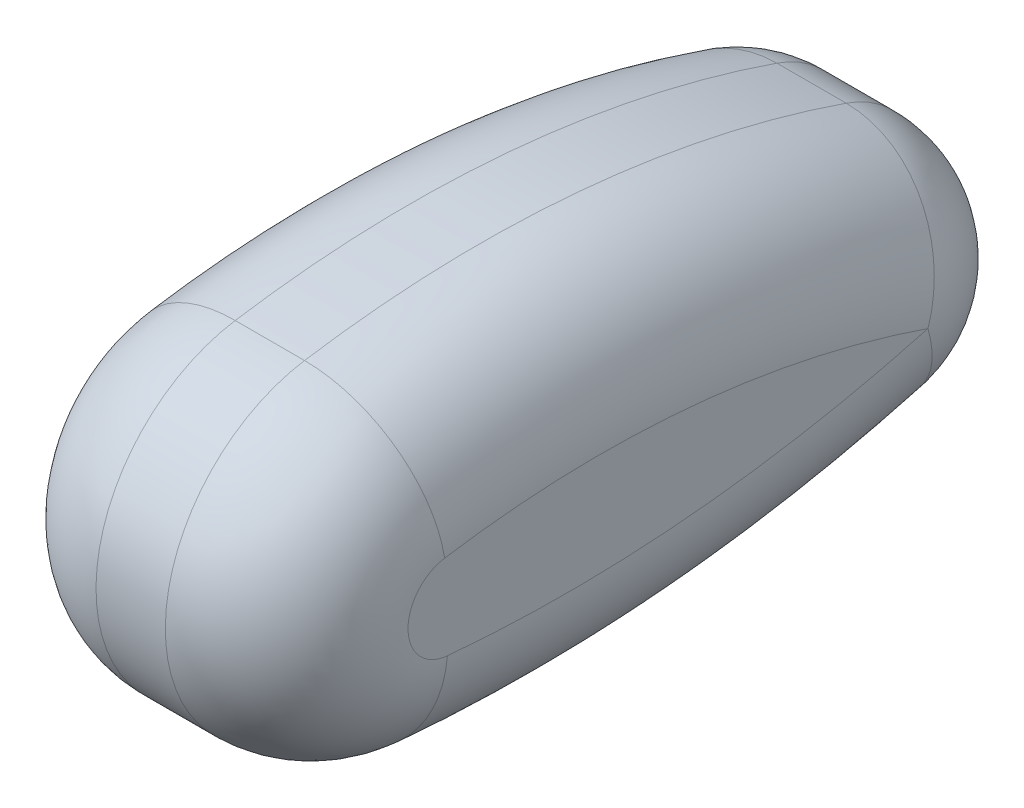
ISO-10303-21;
HEADER;
FILE_DESCRIPTION(('STEP AP214'),'2;1');
FILE_NAME('part.step','',(''),(''),'','','');
FILE_SCHEMA(('AUTOMOTIVE_DESIGN { 1 0 10303 214 1 1 1 1 }'));
ENDSEC;
DATA;
#1=APPLICATION_CONTEXT('core data for automotive mechanical design processes');
#2=APPLICATION_PROTOCOL_DEFINITION('international standard','automotive_design',2000,#1);
#3=PRODUCT_CONTEXT('',#1,'mechanical');
#4=PRODUCT('Part','Part','',(#3));
#5=PRODUCT_RELATED_PRODUCT_CATEGORY('part','',(#4));
#6=PRODUCT_DEFINITION_FORMATION('','',#4);
#7=PRODUCT_DEFINITION_CONTEXT('part definition',#1,'design');
#8=PRODUCT_DEFINITION('design','',#6,#7);
#9=PRODUCT_DEFINITION_SHAPE('','',#8);
#10=(LENGTH_UNIT() NAMED_UNIT(*) SI_UNIT(.MILLI.,.METRE.));
#11=(NAMED_UNIT(*) PLANE_ANGLE_UNIT() SI_UNIT($,.RADIAN.));
#12=(NAMED_UNIT(*) SI_UNIT($,.STERADIAN.) SOLID_ANGLE_UNIT());
#13=UNCERTAINTY_MEASURE_WITH_UNIT(LENGTH_MEASURE(1.E-05),#10,'distance_accuracy_value','');
#14=(GEOMETRIC_REPRESENTATION_CONTEXT(3) GLOBAL_UNCERTAINTY_ASSIGNED_CONTEXT((#13)) GLOBAL_UNIT_ASSIGNED_CONTEXT((#10,
#11,#12)) REPRESENTATION_CONTEXT('',''));
#15=CARTESIAN_POINT('',(0.,0.,0.));
#16=DIRECTION('',(0.,0.,1.));
#17=DIRECTION('',(1.,0.,0.));
#18=AXIS2_PLACEMENT_3D('',#15,#16,#17);
#19=CARTESIAN_POINT('',(-2.,75.1956126731424,-6.77272727272729));
#20=DIRECTION('',(-1.,0.,0.));
#21=DIRECTION('',(0.,0.,1.));
#22=AXIS2_PLACEMENT_3D('',#19,#20,#21);
#23=TOROIDAL_SURFACE('',#22,78.,7.);
#24=CARTESIAN_POINT('',(-2.,-2.48992094944181,0.224262492474415));
#25=DIRECTION('',(0.,0.0897049969897655,0.995968379776721));
#26=DIRECTION('',(0.,-0.995968379776721,0.0897049969897655));
#27=AXIS2_PLACEMENT_3D('',#24,#25,#26);
#28=CIRCLE('',#27,7.);
#29=CARTESIAN_POINT('',(-9.,-2.48992094944181,0.224262492474415));
#30=VERTEX_POINT('',#29);
#31=CARTESIAN_POINT('',(-2.,-9.46169960787885,0.852197471402773));
#32=VERTEX_POINT('',#31);
#33=EDGE_CURVE('E11',#30,#32,#28,.T.);
#34=ORIENTED_EDGE('',*,*,#33,.F.);
#35=CARTESIAN_POINT('',(-9.,75.1956126731424,-6.77272727272729));
#36=DIRECTION('',(-1.,0.,0.));
#37=DIRECTION('',(0.,0.,1.));
#38=AXIS2_PLACEMENT_3D('',#35,#36,#37);
#39=CIRCLE('',#38,78.);
#40=CARTESIAN_POINT('',(-9.,0.,-27.5));
#41=VERTEX_POINT('',#40);
#42=EDGE_CURVE('E220',#41,#30,#39,.T.);
#43=ORIENTED_EDGE('',*,*,#42,.F.);
#44=CARTESIAN_POINT('',(-2.,0.,-27.5));
#45=DIRECTION('',(0.,-0.265734265734264,0.964046316322339));
#46=DIRECTION('',(0.,-0.964046316322339,-0.265734265734264));
#47=AXIS2_PLACEMENT_3D('',#44,#45,#46);
#48=CIRCLE('',#47,7.);
#49=CARTESIAN_POINT('',(-2.,-6.74832421425639,-29.3601398601398));
#50=VERTEX_POINT('',#49);
#51=EDGE_CURVE('E38',#41,#50,#48,.T.);
#52=ORIENTED_EDGE('',*,*,#51,.T.);
#53=CARTESIAN_POINT('',(-2.,75.1956126731424,-6.77272727272729));
#54=DIRECTION('',(-1.,0.,0.));
#55=DIRECTION('',(0.,0.,1.));
#56=AXIS2_PLACEMENT_3D('',#53,#54,#55);
#57=CIRCLE('',#56,85.);
#58=EDGE_CURVE('E237',#32,#50,#57,.F.);
#59=ORIENTED_EDGE('',*,*,#58,.F.);
#60=EDGE_LOOP('',(#34,#43,#52,#59));
#61=FACE_BOUND('',#60,.T.);
#62=ADVANCED_FACE('F31',(#61),#23,.T.);
#63=CARTESIAN_POINT('',(-2.,0.,-27.5));
#64=DIRECTION('',(0.,0.,1.));
#65=DIRECTION('',(1.,0.,0.));
#66=AXIS2_PLACEMENT_3D('',#63,#64,#65);
#67=SPHERICAL_SURFACE('',#66,7.);
#68=ORIENTED_EDGE('',*,*,#51,.F.);
#69=CARTESIAN_POINT('',(-2.,0.,-27.5));
#70=DIRECTION('',(0.,-0.326018808777429,-0.945363282724343));
#71=DIRECTION('',(0.,0.945363282724343,-0.326018808777429));
#72=AXIS2_PLACEMENT_3D('',#69,#70,#71);
#73=CIRCLE('',#72,7.);
#74=CARTESIAN_POINT('',(-2.,6.61754297907041,-29.782131661442));
#75=VERTEX_POINT('',#74);
#76=EDGE_CURVE('E51',#41,#75,#73,.T.);
#77=ORIENTED_EDGE('',*,*,#76,.T.);
#78=CARTESIAN_POINT('',(-2.,0.,-27.5));
#79=DIRECTION('',(-1.,0.,0.));
#80=DIRECTION('',(0.,0.,1.));
#81=AXIS2_PLACEMENT_3D('',#78,#79,#80);
#82=CIRCLE('',#81,7.00000000000001);
#83=EDGE_CURVE('E235',#50,#75,#82,.F.);
#84=ORIENTED_EDGE('',*,*,#83,.F.);
#85=EDGE_LOOP('',(#68,#77,#84));
#86=FACE_BOUND('',#85,.T.);
#87=ADVANCED_FACE('F270',(#86),#67,.T.);
#88=CARTESIAN_POINT('',(-2.,-54.8310703980119,-8.59090909090909));
#89=DIRECTION('',(-1.,0.,0.));
#90=DIRECTION('',(0.,0.,1.));
#91=AXIS2_PLACEMENT_3D('',#88,#89,#90);
#92=TOROIDAL_SURFACE('',#91,58.,7.);
#93=ORIENTED_EDGE('',*,*,#76,.F.);
#94=CARTESIAN_POINT('',(-9.,-54.8310703980119,-8.59090909090909));
#95=DIRECTION('',(-1.,0.,0.));
#96=DIRECTION('',(0.,0.,1.));
#97=AXIS2_PLACEMENT_3D('',#94,#95,#96);
#98=CIRCLE('',#97,58.);
#99=CARTESIAN_POINT('',(-9.,2.46986803594649,0.386977886977889));
#100=VERTEX_POINT('',#99);
#101=EDGE_CURVE('E223',#100,#41,#98,.T.);
#102=ORIENTED_EDGE('',*,*,#101,.F.);
#103=CARTESIAN_POINT('',(-2.,2.46986803594649,0.386977886977888));
#104=DIRECTION('',(0.,0.154791154791155,-0.987947214378593));
#105=DIRECTION('',(0.,0.987947214378593,0.154791154791155));
#106=AXIS2_PLACEMENT_3D('',#103,#104,#105);
#107=CIRCLE('',#106,7.);
#108=CARTESIAN_POINT('',(-2.,9.38549853659664,1.47051597051597));
#109=VERTEX_POINT('',#108);
#110=EDGE_CURVE('E239',#100,#109,#107,.T.);
#111=ORIENTED_EDGE('',*,*,#110,.T.);
#112=CARTESIAN_POINT('',(-2.,-54.8310703980119,-8.59090909090909));
#113=DIRECTION('',(-1.,0.,0.));
#114=DIRECTION('',(0.,0.,1.));
#115=AXIS2_PLACEMENT_3D('',#112,#113,#114);
#116=CIRCLE('',#115,65.);
#117=EDGE_CURVE('E232',#75,#109,#116,.F.);
#118=ORIENTED_EDGE('',*,*,#117,.F.);
#119=EDGE_LOOP('',(#93,#102,#111,#118));
#120=FACE_BOUND('',#119,.T.);
#121=ADVANCED_FACE('F244',(#120),#92,.T.);
#122=CARTESIAN_POINT('',(-2.,0.,0.));
#123=DIRECTION('',(-1.,0.,0.));
#124=DIRECTION('',(0.,0.,1.));
#125=AXIS2_PLACEMENT_3D('',#122,#123,#124);
#126=DEGENERATE_TOROIDAL_SURFACE('',#125,2.50000000000001,7.,.T.);
#127=CARTESIAN_POINT('',(-9.,0.,0.));
#128=DIRECTION('',(-1.,0.,0.));
#129=DIRECTION('',(0.,0.,1.));
#130=AXIS2_PLACEMENT_3D('',#127,#128,#129);
#131=CIRCLE('',#130,2.50000000000001);
#132=EDGE_CURVE('E226',#30,#100,#131,.T.);
#133=ORIENTED_EDGE('',*,*,#132,.F.);
#134=ORIENTED_EDGE('',*,*,#33,.T.);
#135=CARTESIAN_POINT('',(-2.,0.,0.));
#136=DIRECTION('',(-1.,0.,0.));
#137=DIRECTION('',(0.,0.,1.));
#138=AXIS2_PLACEMENT_3D('',#135,#136,#137);
#139=CIRCLE('',#138,9.50000000000001);
#140=EDGE_CURVE('E229',#109,#32,#139,.F.);
#141=ORIENTED_EDGE('',*,*,#140,.F.);
#142=ORIENTED_EDGE('',*,*,#110,.F.);
#143=EDGE_LOOP('',(#133,#134,#141,#142));
#144=FACE_BOUND('',#143,.T.);
#145=ADVANCED_FACE('F252',(#144),#126,.T.);
#146=CARTESIAN_POINT('',(2.,75.1956126731424,-6.77272727272729));
#147=DIRECTION('',(-1.,0.,0.));
#148=DIRECTION('',(0.,0.,1.));
#149=AXIS2_PLACEMENT_3D('',#146,#147,#148);
#150=TOROIDAL_SURFACE('',#149,78.,7.);
#151=CARTESIAN_POINT('',(2.,0.,-27.5));
#152=DIRECTION('',(0.,0.265734265734265,-0.964046316322339));
#153=DIRECTION('',(0.,0.964046316322339,0.265734265734265));
#154=AXIS2_PLACEMENT_3D('',#151,#152,#153);
#155=CIRCLE('',#154,7.);
#156=CARTESIAN_POINT('',(9.,0.,-27.5));
#157=VERTEX_POINT('',#156);
#158=CARTESIAN_POINT('',(2.,-6.74832421425639,-29.3601398601398));
#159=VERTEX_POINT('',#158);
#160=EDGE_CURVE('E218',#157,#159,#155,.T.);
#161=ORIENTED_EDGE('',*,*,#160,.F.);
#162=CARTESIAN_POINT('',(9.,75.1956126731424,-6.77272727272729));
#163=DIRECTION('',(-1.,0.,0.));
#164=DIRECTION('',(0.,0.,1.));
#165=AXIS2_PLACEMENT_3D('',#162,#163,#164);
#166=CIRCLE('',#165,78.);
#167=CARTESIAN_POINT('',(9.,-2.48992094944181,0.224262492474415));
#168=VERTEX_POINT('',#167);
#169=EDGE_CURVE('E194',#168,#157,#166,.F.);
#170=ORIENTED_EDGE('',*,*,#169,.F.);
#171=CARTESIAN_POINT('',(2.,-2.48992094944181,0.224262492474414));
#172=DIRECTION('',(0.,-0.0897049969897655,-0.995968379776721));
#173=DIRECTION('',(0.,0.995968379776721,-0.0897049969897655));
#174=AXIS2_PLACEMENT_3D('',#171,#172,#173);
#175=CIRCLE('',#174,7.);
#176=CARTESIAN_POINT('',(2.,-9.46169960787885,0.852197471402773));
#177=VERTEX_POINT('',#176);
#178=EDGE_CURVE('E216',#168,#177,#175,.T.);
#179=ORIENTED_EDGE('',*,*,#178,.T.);
#180=CARTESIAN_POINT('',(2.,75.1956126731424,-6.77272727272729));
#181=DIRECTION('',(-1.,0.,0.));
#182=DIRECTION('',(0.,0.,1.));
#183=AXIS2_PLACEMENT_3D('',#180,#181,#182);
#184=CIRCLE('',#183,85.);
#185=EDGE_CURVE('E209',#159,#177,#184,.T.);
#186=ORIENTED_EDGE('',*,*,#185,.F.);
#187=EDGE_LOOP('',(#161,#170,#179,#186));
#188=FACE_BOUND('',#187,.T.);
#189=ADVANCED_FACE('F276',(#188),#150,.T.);
#190=CARTESIAN_POINT('',(2.,0.,0.));
#191=DIRECTION('',(-1.,0.,0.));
#192=DIRECTION('',(0.,0.,1.));
#193=AXIS2_PLACEMENT_3D('',#190,#191,#192);
#194=DEGENERATE_TOROIDAL_SURFACE('',#193,2.50000000000001,7.,.T.);
#195=ORIENTED_EDGE('',*,*,#178,.F.);
#196=CARTESIAN_POINT('',(9.,0.,0.));
#197=DIRECTION('',(-1.,0.,0.));
#198=DIRECTION('',(0.,0.,1.));
#199=AXIS2_PLACEMENT_3D('',#196,#197,#198);
#200=CIRCLE('',#199,2.50000000000001);
#201=CARTESIAN_POINT('',(9.,2.46986803594649,0.386977886977888));
#202=VERTEX_POINT('',#201);
#203=EDGE_CURVE('E197',#202,#168,#200,.F.);
#204=ORIENTED_EDGE('',*,*,#203,.F.);
#205=CARTESIAN_POINT('',(2.,2.46986803594649,0.386977886977889));
#206=DIRECTION('',(0.,-0.154791154791155,0.987947214378593));
#207=DIRECTION('',(0.,-0.987947214378593,-0.154791154791155));
#208=AXIS2_PLACEMENT_3D('',#205,#206,#207);
#209=CIRCLE('',#208,7.);
#210=CARTESIAN_POINT('',(2.,9.38549853659664,1.47051597051597));
#211=VERTEX_POINT('',#210);
#212=EDGE_CURVE('E214',#202,#211,#209,.T.);
#213=ORIENTED_EDGE('',*,*,#212,.T.);
#214=CARTESIAN_POINT('',(2.,0.,0.));
#215=DIRECTION('',(-1.,0.,0.));
#216=DIRECTION('',(0.,0.,1.));
#217=AXIS2_PLACEMENT_3D('',#214,#215,#216);
#218=CIRCLE('',#217,9.50000000000001);
#219=EDGE_CURVE('E206',#177,#211,#218,.T.);
#220=ORIENTED_EDGE('',*,*,#219,.F.);
#221=EDGE_LOOP('',(#195,#204,#213,#220));
#222=FACE_BOUND('',#221,.T.);
#223=ADVANCED_FACE('F279',(#222),#194,.T.);
#224=CARTESIAN_POINT('',(2.,-54.8310703980119,-8.59090909090909));
#225=DIRECTION('',(-1.,0.,0.));
#226=DIRECTION('',(0.,0.,1.));
#227=AXIS2_PLACEMENT_3D('',#224,#225,#226);
#228=TOROIDAL_SURFACE('',#227,58.,7.);
#229=ORIENTED_EDGE('',*,*,#212,.F.);
#230=CARTESIAN_POINT('',(9.,-54.8310703980119,-8.59090909090909));
#231=DIRECTION('',(-1.,0.,0.));
#232=DIRECTION('',(0.,0.,1.));
#233=AXIS2_PLACEMENT_3D('',#230,#231,#232);
#234=CIRCLE('',#233,58.);
#235=EDGE_CURVE('E200',#157,#202,#234,.F.);
#236=ORIENTED_EDGE('',*,*,#235,.F.);
#237=CARTESIAN_POINT('',(2.,0.,-27.5));
#238=DIRECTION('',(0.,0.326018808777429,0.945363282724343));
#239=DIRECTION('',(0.,-0.945363282724343,0.326018808777429));
#240=AXIS2_PLACEMENT_3D('',#237,#238,#239);
#241=CIRCLE('',#240,7.);
#242=CARTESIAN_POINT('',(2.,6.61754297907041,-29.782131661442));
#243=VERTEX_POINT('',#242);
#244=EDGE_CURVE('E212',#157,#243,#241,.T.);
#245=ORIENTED_EDGE('',*,*,#244,.T.);
#246=CARTESIAN_POINT('',(2.,-54.8310703980119,-8.59090909090909));
#247=DIRECTION('',(-1.,0.,0.));
#248=DIRECTION('',(0.,0.,1.));
#249=AXIS2_PLACEMENT_3D('',#246,#247,#248);
#250=CIRCLE('',#249,65.);
#251=EDGE_CURVE('E203',#211,#243,#250,.T.);
#252=ORIENTED_EDGE('',*,*,#251,.F.);
#253=EDGE_LOOP('',(#229,#236,#245,#252));
#254=FACE_BOUND('',#253,.T.);
#255=ADVANCED_FACE('F260',(#254),#228,.T.);
#256=CARTESIAN_POINT('',(2.,0.,-27.5));
#257=DIRECTION('',(0.,0.,1.));
#258=DIRECTION('',(1.,0.,0.));
#259=AXIS2_PLACEMENT_3D('',#256,#257,#258);
#260=SPHERICAL_SURFACE('',#259,7.);
#261=ORIENTED_EDGE('',*,*,#244,.F.);
#262=ORIENTED_EDGE('',*,*,#160,.T.);
#263=CARTESIAN_POINT('',(2.,0.,-27.5));
#264=DIRECTION('',(-1.,0.,0.));
#265=DIRECTION('',(0.,0.,1.));
#266=AXIS2_PLACEMENT_3D('',#263,#264,#265);
#267=CIRCLE('',#266,7.00000000000001);
#268=EDGE_CURVE('E191',#243,#159,#267,.T.);
#269=ORIENTED_EDGE('',*,*,#268,.F.);
#270=EDGE_LOOP('',(#261,#262,#269));
#271=FACE_BOUND('',#270,.T.);
#272=ADVANCED_FACE('F265',(#271),#260,.T.);
#273=CARTESIAN_POINT('',(9.,-54.8310703980119,-8.59090909090909));
#274=DIRECTION('',(-1.,0.,0.));
#275=DIRECTION('',(0.,0.,1.));
#276=AXIS2_PLACEMENT_3D('',#273,#274,#275);
#277=CYLINDRICAL_SURFACE('',#276,65.);
#278=DIRECTION('',(-1.,0.,0.));
#279=VECTOR('',#278,1.);
#280=CARTESIAN_POINT('',(9.,6.61754297907041,-29.782131661442));
#281=LINE('',#280,#279);
#282=EDGE_CURVE('E179',#243,#75,#281,.T.);
#283=ORIENTED_EDGE('',*,*,#282,.T.);
#284=ORIENTED_EDGE('',*,*,#117,.T.);
#285=DIRECTION('',(-1.,0.,0.));
#286=VECTOR('',#285,1.);
#287=CARTESIAN_POINT('',(9.,9.38549853659664,1.47051597051597));
#288=LINE('',#287,#286);
#289=EDGE_CURVE('E188',#211,#109,#288,.T.);
#290=ORIENTED_EDGE('',*,*,#289,.F.);
#291=ORIENTED_EDGE('',*,*,#251,.T.);
#292=EDGE_LOOP('',(#283,#284,#290,#291));
#293=FACE_BOUND('',#292,.T.);
#294=ADVANCED_FACE('F250',(#293),#277,.T.);
#295=CARTESIAN_POINT('',(9.,0.,0.));
#296=DIRECTION('',(-1.,0.,0.));
#297=DIRECTION('',(0.,0.,1.));
#298=AXIS2_PLACEMENT_3D('',#295,#296,#297);
#299=CYLINDRICAL_SURFACE('',#298,9.50000000000001);
#300=ORIENTED_EDGE('',*,*,#289,.T.);
#301=ORIENTED_EDGE('',*,*,#140,.T.);
#302=DIRECTION('',(-1.,0.,0.));
#303=VECTOR('',#302,1.);
#304=CARTESIAN_POINT('',(9.,-9.46169960787885,0.852197471402773));
#305=LINE('',#304,#303);
#306=EDGE_CURVE('E185',#177,#32,#305,.T.);
#307=ORIENTED_EDGE('',*,*,#306,.F.);
#308=ORIENTED_EDGE('',*,*,#219,.T.);
#309=EDGE_LOOP('',(#300,#301,#307,#308));
#310=FACE_BOUND('',#309,.T.);
#311=ADVANCED_FACE('F255',(#310),#299,.T.);
#312=CARTESIAN_POINT('',(9.,75.1956126731424,-6.77272727272729));
#313=DIRECTION('',(-1.,0.,0.));
#314=DIRECTION('',(0.,0.,1.));
#315=AXIS2_PLACEMENT_3D('',#312,#313,#314);
#316=CYLINDRICAL_SURFACE('',#315,85.);
#317=ORIENTED_EDGE('',*,*,#306,.T.);
#318=ORIENTED_EDGE('',*,*,#58,.T.);
#319=DIRECTION('',(-1.,0.,0.));
#320=VECTOR('',#319,1.);
#321=CARTESIAN_POINT('',(9.,-6.74832421425639,-29.3601398601398));
#322=LINE('',#321,#320);
#323=EDGE_CURVE('E182',#159,#50,#322,.T.);
#324=ORIENTED_EDGE('',*,*,#323,.F.);
#325=ORIENTED_EDGE('',*,*,#185,.T.);
#326=EDGE_LOOP('',(#317,#318,#324,#325));
#327=FACE_BOUND('',#326,.T.);
#328=ADVANCED_FACE('F274',(#327),#316,.T.);
#329=CARTESIAN_POINT('',(9.,0.,-27.5));
#330=DIRECTION('',(-1.,0.,0.));
#331=DIRECTION('',(0.,0.,1.));
#332=AXIS2_PLACEMENT_3D('',#329,#330,#331);
#333=CYLINDRICAL_SURFACE('',#332,7.00000000000001);
#334=ORIENTED_EDGE('',*,*,#323,.T.);
#335=ORIENTED_EDGE('',*,*,#83,.T.);
#336=ORIENTED_EDGE('',*,*,#282,.F.);
#337=ORIENTED_EDGE('',*,*,#268,.T.);
#338=EDGE_LOOP('',(#334,#335,#336,#337));
#339=FACE_BOUND('',#338,.T.);
#340=ADVANCED_FACE('F269',(#339),#333,.T.);
#341=CARTESIAN_POINT('',(9.,-27.4155351990059,-18.0454545454545));
#342=DIRECTION('',(-1.,0.,0.));
#343=DIRECTION('',(0.,0.,1.));
#344=AXIS2_PLACEMENT_3D('',#341,#342,#343);
#345=PLANE('',#344);
#346=ORIENTED_EDGE('',*,*,#169,.T.);
#347=ORIENTED_EDGE('',*,*,#235,.T.);
#348=ORIENTED_EDGE('',*,*,#203,.T.);
#349=EDGE_LOOP('',(#346,#347,#348));
#350=FACE_BOUND('',#349,.T.);
#351=ADVANCED_FACE('F281',(#350),#345,.F.);
#352=CARTESIAN_POINT('',(-9.,-27.4155351990059,-18.0454545454545));
#353=DIRECTION('',(-1.,0.,0.));
#354=DIRECTION('',(0.,0.,1.));
#355=AXIS2_PLACEMENT_3D('',#352,#353,#354);
#356=PLANE('',#355);
#357=ORIENTED_EDGE('',*,*,#42,.T.);
#358=ORIENTED_EDGE('',*,*,#132,.T.);
#359=ORIENTED_EDGE('',*,*,#101,.T.);
#360=EDGE_LOOP('',(#357,#358,#359));
#361=FACE_BOUND('',#360,.T.);
#362=ADVANCED_FACE('F272',(#361),#356,.T.);
#363=CLOSED_SHELL('',(#62,#87,#121,#145,#189,#223,#255,#272,#294,#311,#328,#340,#351,#362));
#364=CARTESIAN_POINT('',(-5.,2.00000000000001,-29.5));
#365=DIRECTION('',(1.,0.,0.));
#366=DIRECTION('',(0.,0.,-1.));
#367=AXIS2_PLACEMENT_3D('',#364,#365,#366);
#368=CYLINDRICAL_SURFACE('',#367,1.5);
#369=CARTESIAN_POINT('',(-5.,2.00000000000001,-29.5));
#370=DIRECTION('',(1.,0.,0.));
#371=DIRECTION('',(0.,0.,-1.));
#372=AXIS2_PLACEMENT_3D('',#369,#370,#371);
#373=CIRCLE('',#372,1.5);
#374=CARTESIAN_POINT('',(-5.,2.00000000000001,-31.));
#375=VERTEX_POINT('',#374);
#376=EDGE_CURVE('E176',#375,#375,#373,.T.);
#377=ORIENTED_EDGE('',*,*,#376,.F.);
#378=EDGE_LOOP('',(#377));
#379=FACE_BOUND('',#378,.T.);
#380=CARTESIAN_POINT('',(5.,2.00000000000001,-29.5));
#381=DIRECTION('',(1.,0.,0.));
#382=DIRECTION('',(0.,0.,-1.));
#383=AXIS2_PLACEMENT_3D('',#380,#381,#382);
#384=CIRCLE('',#383,1.5);
#385=CARTESIAN_POINT('',(5.,2.00000000000001,-31.));
#386=VERTEX_POINT('',#385);
#387=EDGE_CURVE('E173',#386,#386,#384,.T.);
#388=ORIENTED_EDGE('',*,*,#387,.T.);
#389=EDGE_LOOP('',(#388));
#390=FACE_BOUND('',#389,.T.);
#391=ADVANCED_FACE('F336',(#379,#390),#368,.F.);
#392=CARTESIAN_POINT('',(-5.,2.00000000000001,-29.5));
#393=DIRECTION('',(1.,0.,0.));
#394=DIRECTION('',(0.,0.,-1.));
#395=AXIS2_PLACEMENT_3D('',#392,#393,#394);
#396=PLANE('',#395);
#397=ORIENTED_EDGE('',*,*,#376,.T.);
#398=EDGE_LOOP('',(#397));
#399=FACE_BOUND('',#398,.T.);
#400=ADVANCED_FACE('F340',(#399),#396,.T.);
#401=CARTESIAN_POINT('',(5.,2.00000000000001,-29.5));
#402=DIRECTION('',(1.,0.,0.));
#403=DIRECTION('',(0.,0.,-1.));
#404=AXIS2_PLACEMENT_3D('',#401,#402,#403);
#405=PLANE('',#404);
#406=ORIENTED_EDGE('',*,*,#387,.F.);
#407=EDGE_LOOP('',(#406));
#408=FACE_BOUND('',#407,.T.);
#409=ADVANCED_FACE('F352',(#408),#405,.F.);
#410=CLOSED_SHELL('',(#391,#400,#409));
#411=CARTESIAN_POINT('',(-5.,3.50000000000001,3.50000000000001));
#412=DIRECTION('',(1.,0.,0.));
#413=DIRECTION('',(0.,0.,-1.));
#414=AXIS2_PLACEMENT_3D('',#411,#412,#413);
#415=CYLINDRICAL_SURFACE('',#414,1.5);
#416=CARTESIAN_POINT('',(-5.,3.50000000000001,3.50000000000001));
#417=DIRECTION('',(1.,0.,0.));
#418=DIRECTION('',(0.,0.,-1.));
#419=AXIS2_PLACEMENT_3D('',#416,#417,#418);
#420=CIRCLE('',#419,1.5);
#421=CARTESIAN_POINT('',(-5.,3.50000000000001,2.00000000000001));
#422=VERTEX_POINT('',#421);
#423=EDGE_CURVE('E170',#422,#422,#420,.T.);
#424=ORIENTED_EDGE('',*,*,#423,.F.);
#425=EDGE_LOOP('',(#424));
#426=FACE_BOUND('',#425,.T.);
#427=CARTESIAN_POINT('',(5.,3.50000000000001,3.50000000000001));
#428=DIRECTION('',(1.,0.,0.));
#429=DIRECTION('',(0.,0.,-1.));
#430=AXIS2_PLACEMENT_3D('',#427,#428,#429);
#431=CIRCLE('',#430,1.5);
#432=CARTESIAN_POINT('',(5.,3.50000000000001,2.00000000000001));
#433=VERTEX_POINT('',#432);
#434=EDGE_CURVE('E167',#433,#433,#431,.T.);
#435=ORIENTED_EDGE('',*,*,#434,.T.);
#436=EDGE_LOOP('',(#435));
#437=FACE_BOUND('',#436,.T.);
#438=ADVANCED_FACE('F369',(#426,#437),#415,.F.);
#439=CARTESIAN_POINT('',(-5.,3.50000000000001,3.50000000000001));
#440=DIRECTION('',(1.,0.,0.));
#441=DIRECTION('',(0.,0.,-1.));
#442=AXIS2_PLACEMENT_3D('',#439,#440,#441);
#443=PLANE('',#442);
#444=ORIENTED_EDGE('',*,*,#423,.T.);
#445=EDGE_LOOP('',(#444));
#446=FACE_BOUND('',#445,.T.);
#447=ADVANCED_FACE('F372',(#446),#443,.T.);
#448=CARTESIAN_POINT('',(5.,3.50000000000001,3.50000000000001));
#449=DIRECTION('',(1.,0.,0.));
#450=DIRECTION('',(0.,0.,-1.));
#451=AXIS2_PLACEMENT_3D('',#448,#449,#450);
#452=PLANE('',#451);
#453=ORIENTED_EDGE('',*,*,#434,.F.);
#454=EDGE_LOOP('',(#453));
#455=FACE_BOUND('',#454,.T.);
#456=ADVANCED_FACE('F384',(#455),#452,.F.);
#457=CLOSED_SHELL('',(#438,#447,#456));
#458=CARTESIAN_POINT('',(-5.,4.50000000000001,-29.5000000000001));
#459=DIRECTION('',(1.,0.,0.));
#460=DIRECTION('',(0.,0.,-1.));
#461=AXIS2_PLACEMENT_3D('',#458,#459,#460);
#462=CYLINDRICAL_SURFACE('',#461,0.750000000000002);
#463=CARTESIAN_POINT('',(-5.,4.50000000000001,-29.5000000000001));
#464=DIRECTION('',(1.,0.,0.));
#465=DIRECTION('',(0.,0.,-1.));
#466=AXIS2_PLACEMENT_3D('',#463,#464,#465);
#467=CIRCLE('',#466,0.750000000000002);
#468=CARTESIAN_POINT('',(-5.,4.50000000000001,-30.2500000000001));
#469=VERTEX_POINT('',#468);
#470=EDGE_CURVE('E164',#469,#469,#467,.T.);
#471=ORIENTED_EDGE('',*,*,#470,.F.);
#472=EDGE_LOOP('',(#471));
#473=FACE_BOUND('',#472,.T.);
#474=CARTESIAN_POINT('',(5.,4.50000000000001,-29.5000000000001));
#475=DIRECTION('',(1.,0.,0.));
#476=DIRECTION('',(0.,0.,-1.));
#477=AXIS2_PLACEMENT_3D('',#474,#475,#476);
#478=CIRCLE('',#477,0.750000000000002);
#479=CARTESIAN_POINT('',(5.,4.50000000000001,-30.2500000000001));
#480=VERTEX_POINT('',#479);
#481=EDGE_CURVE('E161',#480,#480,#478,.T.);
#482=ORIENTED_EDGE('',*,*,#481,.T.);
#483=EDGE_LOOP('',(#482));
#484=FACE_BOUND('',#483,.T.);
#485=ADVANCED_FACE('F401',(#473,#484),#462,.F.);
#486=CARTESIAN_POINT('',(-5.,4.50000000000001,-29.5000000000001));
#487=DIRECTION('',(1.,0.,0.));
#488=DIRECTION('',(0.,0.,-1.));
#489=AXIS2_PLACEMENT_3D('',#486,#487,#488);
#490=PLANE('',#489);
#491=CARTESIAN_POINT('',(-5.,4.50000000000001,-29.5000000000001));
#492=DIRECTION('',(1.,0.,0.));
#493=DIRECTION('',(0.,0.,-1.));
#494=AXIS2_PLACEMENT_3D('',#491,#492,#493);
#495=CIRCLE('',#494,0.499999999999999);
#496=CARTESIAN_POINT('',(-5.,4.50000000000001,-30.0000000000001));
#497=VERTEX_POINT('',#496);
#498=EDGE_CURVE('E158',#497,#497,#495,.T.);
#499=ORIENTED_EDGE('',*,*,#498,.F.);
#500=EDGE_LOOP('',(#499));
#501=FACE_BOUND('',#500,.T.);
#502=ORIENTED_EDGE('',*,*,#470,.T.);
#503=EDGE_LOOP('',(#502));
#504=FACE_BOUND('',#503,.T.);
#505=ADVANCED_FACE('F404',(#501,#504),#490,.T.);
#506=CARTESIAN_POINT('',(5.,4.50000000000001,-29.5000000000001));
#507=DIRECTION('',(1.,0.,0.));
#508=DIRECTION('',(0.,0.,-1.));
#509=AXIS2_PLACEMENT_3D('',#506,#507,#508);
#510=PLANE('',#509);
#511=CARTESIAN_POINT('',(5.,4.50000000000001,-29.5000000000001));
#512=DIRECTION('',(1.,0.,0.));
#513=DIRECTION('',(0.,0.,-1.));
#514=AXIS2_PLACEMENT_3D('',#511,#512,#513);
#515=CIRCLE('',#514,0.499999999999999);
#516=CARTESIAN_POINT('',(5.,4.50000000000001,-30.0000000000001));
#517=VERTEX_POINT('',#516);
#518=EDGE_CURVE('E152',#517,#517,#515,.T.);
#519=ORIENTED_EDGE('',*,*,#518,.T.);
#520=EDGE_LOOP('',(#519));
#521=FACE_BOUND('',#520,.T.);
#522=ORIENTED_EDGE('',*,*,#481,.F.);
#523=EDGE_LOOP('',(#522));
#524=FACE_BOUND('',#523,.T.);
#525=ADVANCED_FACE('F416',(#521,#524),#510,.F.);
#526=CARTESIAN_POINT('',(-5.,4.50000000000001,-29.5000000000001));
#527=DIRECTION('',(1.,0.,0.));
#528=DIRECTION('',(0.,0.,-1.));
#529=AXIS2_PLACEMENT_3D('',#526,#527,#528);
#530=CYLINDRICAL_SURFACE('',#529,0.499999999999999);
#531=ORIENTED_EDGE('',*,*,#498,.T.);
#532=EDGE_LOOP('',(#531));
#533=FACE_BOUND('',#532,.T.);
#534=ORIENTED_EDGE('',*,*,#518,.F.);
#535=EDGE_LOOP('',(#534));
#536=FACE_BOUND('',#535,.T.);
#537=ADVANCED_FACE('F426',(#533,#536),#530,.T.);
#538=CLOSED_SHELL('',(#485,#505,#525,#537));
#539=CARTESIAN_POINT('',(-5.,3.50000000000001,3.50000000000001));
#540=DIRECTION('',(1.,0.,0.));
#541=DIRECTION('',(0.,0.,-1.));
#542=AXIS2_PLACEMENT_3D('',#539,#540,#541);
#543=CYLINDRICAL_SURFACE('',#542,3.);
#544=CARTESIAN_POINT('',(5.,3.50000000000001,3.50000000000001));
#545=DIRECTION('',(1.,0.,0.));
#546=DIRECTION('',(0.,0.,-1.));
#547=AXIS2_PLACEMENT_3D('',#544,#545,#546);
#548=CIRCLE('',#547,3.);
#549=CARTESIAN_POINT('',(5.,6.50000000000001,3.50000000000001));
#550=VERTEX_POINT('',#549);
#551=CARTESIAN_POINT('',(5.,2.473939570023,6.31907786235773));
#552=VERTEX_POINT('',#551);
#553=EDGE_CURVE('E131',#550,#552,#548,.T.);
#554=ORIENTED_EDGE('',*,*,#553,.T.);
#555=DIRECTION('',(1.,0.,0.));
#556=VECTOR('',#555,1.);
#557=CARTESIAN_POINT('',(-5.,2.473939570023,6.31907786235773));
#558=LINE('',#557,#556);
#559=CARTESIAN_POINT('',(-5.,2.473939570023,6.31907786235773));
#560=VERTEX_POINT('',#559);
#561=EDGE_CURVE('E113',#560,#552,#558,.T.);
#562=ORIENTED_EDGE('',*,*,#561,.F.);
#563=CARTESIAN_POINT('',(-5.,3.50000000000001,3.50000000000001));
#564=DIRECTION('',(1.,0.,0.));
#565=DIRECTION('',(0.,0.,-1.));
#566=AXIS2_PLACEMENT_3D('',#563,#564,#565);
#567=CIRCLE('',#566,3.);
#568=CARTESIAN_POINT('',(-5.,6.50000000000001,3.50000000000001));
#569=VERTEX_POINT('',#568);
#570=EDGE_CURVE('E143',#569,#560,#567,.T.);
#571=ORIENTED_EDGE('',*,*,#570,.F.);
#572=DIRECTION('',(1.,0.,0.));
#573=VECTOR('',#572,1.);
#574=CARTESIAN_POINT('',(-5.,6.50000000000001,3.50000000000001));
#575=LINE('',#574,#573);
#576=EDGE_CURVE('E137',#569,#550,#575,.T.);
#577=ORIENTED_EDGE('',*,*,#576,.T.);
#578=EDGE_LOOP('',(#554,#562,#571,#577));
#579=FACE_BOUND('',#578,.T.);
#580=ADVANCED_FACE('F136',(#579),#543,.F.);
#581=CARTESIAN_POINT('',(-5.,6.00000000000001,3.50000000000001));
#582=DIRECTION('',(1.,0.,0.));
#583=DIRECTION('',(0.,0.,-1.));
#584=AXIS2_PLACEMENT_3D('',#581,#582,#583);
#585=CYLINDRICAL_SURFACE('',#584,0.5);
#586=CARTESIAN_POINT('',(5.,6.00000000000001,3.50000000000001));
#587=DIRECTION('',(1.,0.,0.));
#588=DIRECTION('',(0.,0.,-1.));
#589=AXIS2_PLACEMENT_3D('',#586,#587,#588);
#590=CIRCLE('',#589,0.5);
#591=CARTESIAN_POINT('',(5.,5.50000000000001,3.50000000000001));
#592=VERTEX_POINT('',#591);
#593=EDGE_CURVE('E141',#592,#550,#590,.T.);
#594=ORIENTED_EDGE('',*,*,#593,.T.);
#595=ORIENTED_EDGE('',*,*,#576,.F.);
#596=CARTESIAN_POINT('',(-5.,6.00000000000001,3.50000000000001));
#597=DIRECTION('',(1.,0.,0.));
#598=DIRECTION('',(0.,0.,-1.));
#599=AXIS2_PLACEMENT_3D('',#596,#597,#598);
#600=CIRCLE('',#599,0.5);
#601=CARTESIAN_POINT('',(-5.,5.50000000000001,3.50000000000001));
#602=VERTEX_POINT('',#601);
#603=EDGE_CURVE('E124',#602,#569,#600,.T.);
#604=ORIENTED_EDGE('',*,*,#603,.F.);
#605=DIRECTION('',(1.,0.,0.));
#606=VECTOR('',#605,1.);
#607=CARTESIAN_POINT('',(-5.,5.50000000000001,3.50000000000001));
#608=LINE('',#607,#606);
#609=EDGE_CURVE('E153',#602,#592,#608,.T.);
#610=ORIENTED_EDGE('',*,*,#609,.T.);
#611=EDGE_LOOP('',(#594,#595,#604,#610));
#612=FACE_BOUND('',#611,.T.);
#613=ADVANCED_FACE('F445',(#612),#585,.F.);
#614=CARTESIAN_POINT('',(-5.,3.50000000000001,3.50000000000001));
#615=DIRECTION('',(1.,0.,0.));
#616=DIRECTION('',(0.,0.,-1.));
#617=AXIS2_PLACEMENT_3D('',#614,#615,#616);
#618=CYLINDRICAL_SURFACE('',#617,2.);
#619=CARTESIAN_POINT('',(5.,3.50000000000001,3.50000000000001));
#620=DIRECTION('',(-1.,0.,0.));
#621=DIRECTION('',(0.,0.,-1.));
#622=AXIS2_PLACEMENT_3D('',#619,#620,#621);
#623=CIRCLE('',#622,2.);
#624=CARTESIAN_POINT('',(5.,2.81595971334867,5.37938524157182));
#625=VERTEX_POINT('',#624);
#626=EDGE_CURVE('E134',#625,#592,#623,.T.);
#627=ORIENTED_EDGE('',*,*,#626,.T.);
#628=ORIENTED_EDGE('',*,*,#609,.F.);
#629=CARTESIAN_POINT('',(-5.,3.50000000000001,3.50000000000001));
#630=DIRECTION('',(-1.,0.,0.));
#631=DIRECTION('',(0.,0.,-1.));
#632=AXIS2_PLACEMENT_3D('',#629,#630,#631);
#633=CIRCLE('',#632,2.);
#634=CARTESIAN_POINT('',(-5.,2.81595971334867,5.37938524157182));
#635=VERTEX_POINT('',#634);
#636=EDGE_CURVE('E146',#635,#602,#633,.T.);
#637=ORIENTED_EDGE('',*,*,#636,.F.);
#638=DIRECTION('',(1.,0.,0.));
#639=VECTOR('',#638,1.);
#640=CARTESIAN_POINT('',(-5.,2.81595971334867,5.37938524157182));
#641=LINE('',#640,#639);
#642=EDGE_CURVE('E123',#635,#625,#641,.T.);
#643=ORIENTED_EDGE('',*,*,#642,.T.);
#644=EDGE_LOOP('',(#627,#628,#637,#643));
#645=FACE_BOUND('',#644,.T.);
#646=ADVANCED_FACE('F456',(#645),#618,.T.);
#647=CARTESIAN_POINT('',(-5.,2.64494964168583,5.84923155196478));
#648=DIRECTION('',(1.,0.,0.));
#649=DIRECTION('',(0.,0.,-1.));
#650=AXIS2_PLACEMENT_3D('',#647,#648,#649);
#651=CYLINDRICAL_SURFACE('',#650,0.500000000000001);
#652=CARTESIAN_POINT('',(5.,2.64494964168583,5.84923155196478));
#653=DIRECTION('',(1.,0.,0.));
#654=DIRECTION('',(0.,0.,-1.));
#655=AXIS2_PLACEMENT_3D('',#652,#653,#654);
#656=CIRCLE('',#655,0.500000000000001);
#657=EDGE_CURVE('E116',#552,#625,#656,.T.);
#658=ORIENTED_EDGE('',*,*,#657,.T.);
#659=ORIENTED_EDGE('',*,*,#642,.F.);
#660=CARTESIAN_POINT('',(-5.,2.64494964168583,5.84923155196478));
#661=DIRECTION('',(1.,0.,0.));
#662=DIRECTION('',(0.,0.,-1.));
#663=AXIS2_PLACEMENT_3D('',#660,#661,#662);
#664=CIRCLE('',#663,0.500000000000001);
#665=EDGE_CURVE('E118',#560,#635,#664,.T.);
#666=ORIENTED_EDGE('',*,*,#665,.F.);
#667=ORIENTED_EDGE('',*,*,#561,.T.);
#668=EDGE_LOOP('',(#658,#659,#666,#667));
#669=FACE_BOUND('',#668,.T.);
#670=ADVANCED_FACE('F115',(#669),#651,.F.);
#671=CARTESIAN_POINT('',(-5.,3.07247482084292,4.67461577598239));
#672=DIRECTION('',(1.,0.,0.));
#673=DIRECTION('',(0.,0.,-1.));
#674=AXIS2_PLACEMENT_3D('',#671,#672,#673);
#675=PLANE('',#674);
#676=ORIENTED_EDGE('',*,*,#570,.T.);
#677=ORIENTED_EDGE('',*,*,#665,.T.);
#678=ORIENTED_EDGE('',*,*,#636,.T.);
#679=ORIENTED_EDGE('',*,*,#603,.T.);
#680=EDGE_LOOP('',(#676,#677,#678,#679));
#681=FACE_BOUND('',#680,.T.);
#682=ADVANCED_FACE('F475',(#681),#675,.T.);
#683=CARTESIAN_POINT('',(5.,3.07247482084292,4.67461577598239));
#684=DIRECTION('',(1.,0.,0.));
#685=DIRECTION('',(0.,0.,-1.));
#686=AXIS2_PLACEMENT_3D('',#683,#684,#685);
#687=PLANE('',#686);
#688=ORIENTED_EDGE('',*,*,#553,.F.);
#689=ORIENTED_EDGE('',*,*,#593,.F.);
#690=ORIENTED_EDGE('',*,*,#626,.F.);
#691=ORIENTED_EDGE('',*,*,#657,.F.);
#692=EDGE_LOOP('',(#688,#689,#690,#691));
#693=FACE_BOUND('',#692,.T.);
#694=ADVANCED_FACE('F129',(#693),#687,.F.);
#695=CLOSED_SHELL('',(#580,#613,#646,#670,#682,#694));
#696=ORIENTED_CLOSED_SHELL('',*,#410,.T.);
#697=ORIENTED_CLOSED_SHELL('',*,#457,.T.);
#698=ORIENTED_CLOSED_SHELL('',*,#538,.T.);
#699=ORIENTED_CLOSED_SHELL('',*,#695,.T.);
#700=BREP_WITH_VOIDS('B2',#363,(#696,#697,#698,#699));
#701=ADVANCED_BREP_SHAPE_REPRESENTATION('',(#18,#700),#14);
#702=SHAPE_DEFINITION_REPRESENTATION(#9,#701);
ENDSEC;
END-ISO-10303-21;
